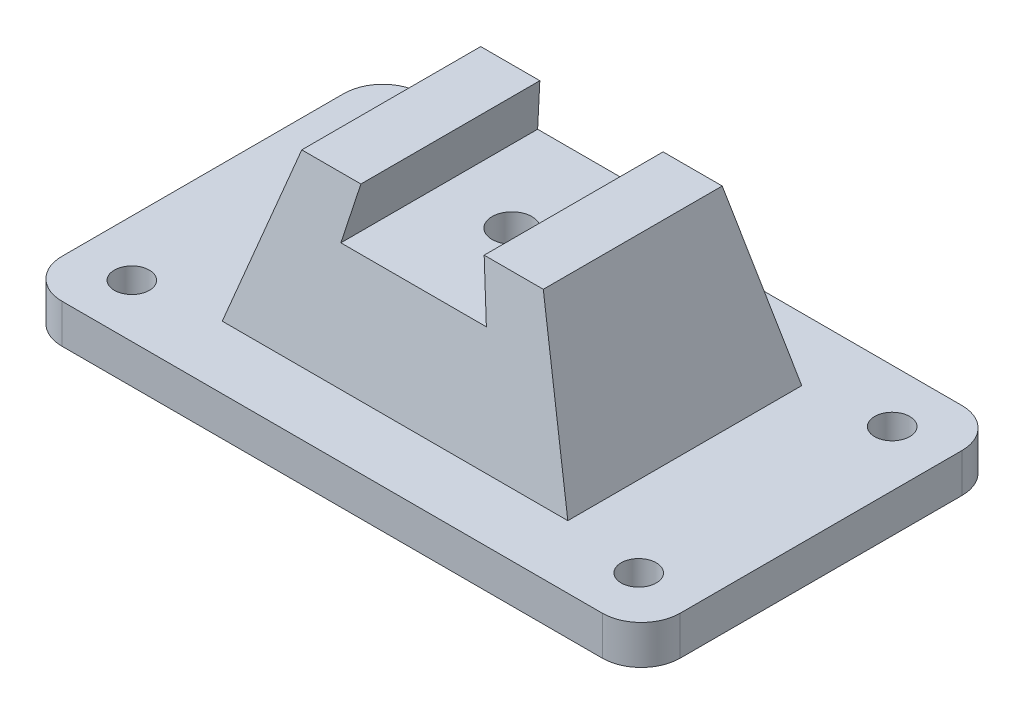
ISO-10303-21;
HEADER;
FILE_DESCRIPTION(('STEP AP214'),'2;1');
FILE_NAME('part.step','',(''),(''),'','','');
FILE_SCHEMA(('AUTOMOTIVE_DESIGN { 1 0 10303 214 1 1 1 1 }'));
ENDSEC;
DATA;
#1=APPLICATION_CONTEXT('core data for automotive mechanical design processes');
#2=APPLICATION_PROTOCOL_DEFINITION('international standard','automotive_design',2000,#1);
#3=PRODUCT_CONTEXT('',#1,'mechanical');
#4=PRODUCT('Part','Part','',(#3));
#5=PRODUCT_RELATED_PRODUCT_CATEGORY('part','',(#4));
#6=PRODUCT_DEFINITION_FORMATION('','',#4);
#7=PRODUCT_DEFINITION_CONTEXT('part definition',#1,'design');
#8=PRODUCT_DEFINITION('design','',#6,#7);
#9=PRODUCT_DEFINITION_SHAPE('','',#8);
#10=(LENGTH_UNIT() NAMED_UNIT(*) SI_UNIT(.MILLI.,.METRE.));
#11=(NAMED_UNIT(*) PLANE_ANGLE_UNIT() SI_UNIT($,.RADIAN.));
#12=(NAMED_UNIT(*) SI_UNIT($,.STERADIAN.) SOLID_ANGLE_UNIT());
#13=UNCERTAINTY_MEASURE_WITH_UNIT(LENGTH_MEASURE(1.E-05),#10,'distance_accuracy_value','');
#14=(GEOMETRIC_REPRESENTATION_CONTEXT(3) GLOBAL_UNCERTAINTY_ASSIGNED_CONTEXT((#13)) GLOBAL_UNIT_ASSIGNED_CONTEXT((#10,
#11,#12)) REPRESENTATION_CONTEXT('',''));
#15=CARTESIAN_POINT('',(0.,0.,0.));
#16=DIRECTION('',(0.,0.,1.));
#17=DIRECTION('',(1.,0.,0.));
#18=AXIS2_PLACEMENT_3D('',#15,#16,#17);
#19=CARTESIAN_POINT('',(-30.9686365671124,51.1938030802326,30.));
#20=DIRECTION('',(0.,-1.,0.));
#21=DIRECTION('',(0.,0.,-1.));
#22=AXIS2_PLACEMENT_3D('',#19,#20,#21);
#23=PLANE('',#22);
#24=DIRECTION('',(1.,0.,0.));
#25=VECTOR('',#24,1.);
#26=CARTESIAN_POINT('',(-79.2749011715995,51.1938030802326,-22.9454042551388));
#27=LINE('',#26,#25);
#28=CARTESIAN_POINT('',(15.8082579966013,51.1938030802326,-22.9454042551388));
#29=VERTEX_POINT('',#28);
#30=CARTESIAN_POINT('',(30.9686365671125,51.1938030802326,-22.9454042551388));
#31=VERTEX_POINT('',#30);
#32=EDGE_CURVE('E171',#29,#31,#27,.T.);
#33=ORIENTED_EDGE('',*,*,#32,.F.);
#34=DIRECTION('',(0.,0.,1.));
#35=VECTOR('',#34,1.);
#36=CARTESIAN_POINT('',(15.8082579966013,51.1938030802326,-46.1247583739828));
#37=LINE('',#36,#35);
#38=CARTESIAN_POINT('',(15.8082579966013,51.1938030802326,22.9454042551387));
#39=VERTEX_POINT('',#38);
#40=EDGE_CURVE('E156',#29,#39,#37,.T.);
#41=ORIENTED_EDGE('',*,*,#40,.T.);
#42=DIRECTION('',(1.,0.,0.));
#43=VECTOR('',#42,1.);
#44=CARTESIAN_POINT('',(-79.2749011715995,51.1938030802326,22.9454042551388));
#45=LINE('',#44,#43);
#46=CARTESIAN_POINT('',(30.9686365671125,51.1938030802326,22.9454042551388));
#47=VERTEX_POINT('',#46);
#48=EDGE_CURVE('E182',#39,#47,#45,.T.);
#49=ORIENTED_EDGE('',*,*,#48,.T.);
#50=DIRECTION('',(0.,0.,-1.));
#51=VECTOR('',#50,1.);
#52=CARTESIAN_POINT('',(30.9686365671124,51.1938030802326,30.));
#53=LINE('',#52,#51);
#54=EDGE_CURVE('E194',#47,#31,#53,.T.);
#55=ORIENTED_EDGE('',*,*,#54,.T.);
#56=EDGE_LOOP('',(#33,#41,#49,#55));
#57=FACE_BOUND('',#56,.T.);
#58=ADVANCED_FACE('F37',(#57),#23,.F.);
#59=CARTESIAN_POINT('',(69.2749011715995,10.,-36.1247583739828));
#60=DIRECTION('',(0.,-1.,0.));
#61=DIRECTION('',(0.,0.,-1.));
#62=AXIS2_PLACEMENT_3D('',#59,#60,#61);
#63=PLANE('',#62);
#64=CARTESIAN_POINT('',(-65.,10.,-32.5));
#65=DIRECTION('',(0.,1.,0.));
#66=DIRECTION('',(0.,0.,1.));
#67=AXIS2_PLACEMENT_3D('',#64,#65,#66);
#68=CIRCLE('',#67,4.5);
#69=CARTESIAN_POINT('',(-65.,10.,-28.));
#70=VERTEX_POINT('',#69);
#71=EDGE_CURVE('E297',#70,#70,#68,.T.);
#72=ORIENTED_EDGE('',*,*,#71,.F.);
#73=EDGE_LOOP('',(#72));
#74=FACE_BOUND('',#73,.T.);
#75=CARTESIAN_POINT('',(65.,10.,-32.5));
#76=DIRECTION('',(0.,1.,0.));
#77=DIRECTION('',(0.,0.,1.));
#78=AXIS2_PLACEMENT_3D('',#75,#76,#77);
#79=CIRCLE('',#78,4.49999999999999);
#80=CARTESIAN_POINT('',(65.,10.,-28.));
#81=VERTEX_POINT('',#80);
#82=EDGE_CURVE('E291',#81,#81,#79,.T.);
#83=ORIENTED_EDGE('',*,*,#82,.F.);
#84=EDGE_LOOP('',(#83));
#85=FACE_BOUND('',#84,.T.);
#86=CARTESIAN_POINT('',(65.,10.,32.5));
#87=DIRECTION('',(0.,1.,0.));
#88=DIRECTION('',(0.,0.,1.));
#89=AXIS2_PLACEMENT_3D('',#86,#87,#88);
#90=CIRCLE('',#89,4.49999999999999);
#91=CARTESIAN_POINT('',(65.,10.,37.));
#92=VERTEX_POINT('',#91);
#93=EDGE_CURVE('E285',#92,#92,#90,.T.);
#94=ORIENTED_EDGE('',*,*,#93,.F.);
#95=EDGE_LOOP('',(#94));
#96=FACE_BOUND('',#95,.T.);
#97=CARTESIAN_POINT('',(-65.,10.,32.5));
#98=DIRECTION('',(0.,1.,0.));
#99=DIRECTION('',(0.,0.,1.));
#100=AXIS2_PLACEMENT_3D('',#97,#98,#99);
#101=CIRCLE('',#100,4.5);
#102=CARTESIAN_POINT('',(-65.,10.,37.));
#103=VERTEX_POINT('',#102);
#104=EDGE_CURVE('E274',#103,#103,#101,.T.);
#105=ORIENTED_EDGE('',*,*,#104,.F.);
#106=EDGE_LOOP('',(#105));
#107=FACE_BOUND('',#106,.T.);
#108=DIRECTION('',(1.,0.,0.));
#109=VECTOR('',#108,1.);
#110=CARTESIAN_POINT('',(-44.314952744571,10.,-30.));
#111=LINE('',#110,#109);
#112=CARTESIAN_POINT('',(-44.314952744571,10.,-30.));
#113=VERTEX_POINT('',#112);
#114=CARTESIAN_POINT('',(44.314952744571,10.,-30.));
#115=VERTEX_POINT('',#114);
#116=EDGE_CURVE('E191',#113,#115,#111,.T.);
#117=ORIENTED_EDGE('',*,*,#116,.T.);
#118=DIRECTION('',(0.,0.,-1.));
#119=VECTOR('',#118,1.);
#120=CARTESIAN_POINT('',(44.314952744571,10.,30.));
#121=LINE('',#120,#119);
#122=CARTESIAN_POINT('',(44.314952744571,10.,30.));
#123=VERTEX_POINT('',#122);
#124=EDGE_CURVE('E199',#123,#115,#121,.T.);
#125=ORIENTED_EDGE('',*,*,#124,.F.);
#126=DIRECTION('',(1.,0.,0.));
#127=VECTOR('',#126,1.);
#128=CARTESIAN_POINT('',(-44.314952744571,10.,30.));
#129=LINE('',#128,#127);
#130=CARTESIAN_POINT('',(-44.314952744571,10.,30.));
#131=VERTEX_POINT('',#130);
#132=EDGE_CURVE('E192',#131,#123,#129,.T.);
#133=ORIENTED_EDGE('',*,*,#132,.F.);
#134=DIRECTION('',(0.,0.,-1.));
#135=VECTOR('',#134,1.);
#136=CARTESIAN_POINT('',(-44.314952744571,10.,30.));
#137=LINE('',#136,#135);
#138=EDGE_CURVE('E201',#131,#113,#137,.T.);
#139=ORIENTED_EDGE('',*,*,#138,.T.);
#140=EDGE_LOOP('',(#117,#125,#133,#139));
#141=FACE_BOUND('',#140,.T.);
#142=DIRECTION('',(0.,0.,-1.));
#143=VECTOR('',#142,1.);
#144=CARTESIAN_POINT('',(79.2749011715995,10.,-36.1247583739828));
#145=LINE('',#144,#143);
#146=CARTESIAN_POINT('',(79.2749011715995,10.,36.1247583739828));
#147=VERTEX_POINT('',#146);
#148=CARTESIAN_POINT('',(79.2749011715995,10.,-36.1247583739828));
#149=VERTEX_POINT('',#148);
#150=EDGE_CURVE('E224',#147,#149,#145,.T.);
#151=ORIENTED_EDGE('',*,*,#150,.T.);
#152=CARTESIAN_POINT('',(69.2749011715995,10.,-36.1247583739828));
#153=DIRECTION('',(0.,1.,0.));
#154=DIRECTION('',(0.,0.,-1.));
#155=AXIS2_PLACEMENT_3D('',#152,#153,#154);
#156=CIRCLE('',#155,9.99999999999999);
#157=CARTESIAN_POINT('',(69.2749011715995,10.,-46.1247583739828));
#158=VERTEX_POINT('',#157);
#159=EDGE_CURVE('E208',#149,#158,#156,.T.);
#160=ORIENTED_EDGE('',*,*,#159,.T.);
#161=DIRECTION('',(-1.,0.,0.));
#162=VECTOR('',#161,1.);
#163=CARTESIAN_POINT('',(-69.2749011715995,10.,-46.1247583739828));
#164=LINE('',#163,#162);
#165=CARTESIAN_POINT('',(-69.2749011715995,10.,-46.1247583739828));
#166=VERTEX_POINT('',#165);
#167=EDGE_CURVE('E211',#158,#166,#164,.T.);
#168=ORIENTED_EDGE('',*,*,#167,.T.);
#169=CARTESIAN_POINT('',(-69.2749011715995,10.,-36.1247583739828));
#170=DIRECTION('',(0.,1.,0.));
#171=DIRECTION('',(0.,0.,1.));
#172=AXIS2_PLACEMENT_3D('',#169,#170,#171);
#173=CIRCLE('',#172,9.99999999999999);
#174=CARTESIAN_POINT('',(-79.2749011715995,10.,-36.1247583739828));
#175=VERTEX_POINT('',#174);
#176=EDGE_CURVE('E214',#166,#175,#173,.T.);
#177=ORIENTED_EDGE('',*,*,#176,.T.);
#178=DIRECTION('',(0.,0.,1.));
#179=VECTOR('',#178,1.);
#180=CARTESIAN_POINT('',(-79.2749011715995,10.,-36.1247583739828));
#181=LINE('',#180,#179);
#182=CARTESIAN_POINT('',(-79.2749011715995,10.,36.1247583739828));
#183=VERTEX_POINT('',#182);
#184=EDGE_CURVE('E216',#175,#183,#181,.T.);
#185=ORIENTED_EDGE('',*,*,#184,.T.);
#186=CARTESIAN_POINT('',(-69.2749011715995,10.,36.1247583739828));
#187=DIRECTION('',(0.,1.,0.));
#188=DIRECTION('',(0.,0.,1.));
#189=AXIS2_PLACEMENT_3D('',#186,#187,#188);
#190=CIRCLE('',#189,9.99999999999999);
#191=CARTESIAN_POINT('',(-69.2749011715995,10.,46.1247583739828));
#192=VERTEX_POINT('',#191);
#193=EDGE_CURVE('E218',#183,#192,#190,.T.);
#194=ORIENTED_EDGE('',*,*,#193,.T.);
#195=DIRECTION('',(1.,0.,0.));
#196=VECTOR('',#195,1.);
#197=CARTESIAN_POINT('',(-69.2749011715995,10.,46.1247583739828));
#198=LINE('',#197,#196);
#199=CARTESIAN_POINT('',(69.2749011715995,10.,46.1247583739828));
#200=VERTEX_POINT('',#199);
#201=EDGE_CURVE('E220',#192,#200,#198,.T.);
#202=ORIENTED_EDGE('',*,*,#201,.T.);
#203=CARTESIAN_POINT('',(69.2749011715995,10.,36.1247583739828));
#204=DIRECTION('',(0.,1.,0.));
#205=DIRECTION('',(0.,0.,1.));
#206=AXIS2_PLACEMENT_3D('',#203,#204,#205);
#207=CIRCLE('',#206,9.99999999999999);
#208=EDGE_CURVE('E222',#200,#147,#207,.T.);
#209=ORIENTED_EDGE('',*,*,#208,.T.);
#210=EDGE_LOOP('',(#151,#160,#168,#177,#185,#194,#202,#209));
#211=FACE_BOUND('',#210,.T.);
#212=ADVANCED_FACE('F321',(#74,#85,#96,#107,#141,#211),#63,.F.);
#213=CARTESIAN_POINT('',(69.2749011715995,10.,-36.1247583739828));
#214=DIRECTION('',(0.,-1.,0.));
#215=DIRECTION('',(0.,0.,-1.));
#216=AXIS2_PLACEMENT_3D('',#213,#214,#215);
#217=CYLINDRICAL_SURFACE('',#216,9.99999999999999);
#218=CARTESIAN_POINT('',(69.2749011715995,0.,-36.1247583739828));
#219=DIRECTION('',(0.,1.,0.));
#220=DIRECTION('',(0.,0.,-1.));
#221=AXIS2_PLACEMENT_3D('',#218,#219,#220);
#222=CIRCLE('',#221,9.99999999999999);
#223=CARTESIAN_POINT('',(79.2749011715995,0.,-36.1247583739828));
#224=VERTEX_POINT('',#223);
#225=CARTESIAN_POINT('',(69.2749011715995,0.,-46.1247583739828));
#226=VERTEX_POINT('',#225);
#227=EDGE_CURVE('E207',#224,#226,#222,.T.);
#228=ORIENTED_EDGE('',*,*,#227,.T.);
#229=DIRECTION('',(0.,-1.,0.));
#230=VECTOR('',#229,1.);
#231=CARTESIAN_POINT('',(69.2749011715995,10.,-46.1247583739828));
#232=LINE('',#231,#230);
#233=EDGE_CURVE('E262',#158,#226,#232,.T.);
#234=ORIENTED_EDGE('',*,*,#233,.F.);
#235=ORIENTED_EDGE('',*,*,#159,.F.);
#236=DIRECTION('',(0.,-1.,0.));
#237=VECTOR('',#236,1.);
#238=CARTESIAN_POINT('',(79.2749011715995,10.,-36.1247583739828));
#239=LINE('',#238,#237);
#240=EDGE_CURVE('E226',#149,#224,#239,.T.);
#241=ORIENTED_EDGE('',*,*,#240,.T.);
#242=EDGE_LOOP('',(#228,#234,#235,#241));
#243=FACE_BOUND('',#242,.T.);
#244=ADVANCED_FACE('F39',(#243),#217,.T.);
#245=CARTESIAN_POINT('',(-69.2749011715995,10.,-46.1247583739828));
#246=DIRECTION('',(0.,0.,1.));
#247=DIRECTION('',(1.,0.,0.));
#248=AXIS2_PLACEMENT_3D('',#245,#246,#247);
#249=PLANE('',#248);
#250=DIRECTION('',(-1.,0.,0.));
#251=VECTOR('',#250,1.);
#252=CARTESIAN_POINT('',(-69.2749011715995,0.,-46.1247583739828));
#253=LINE('',#252,#251);
#254=CARTESIAN_POINT('',(-69.2749011715995,0.,-46.1247583739828));
#255=VERTEX_POINT('',#254);
#256=EDGE_CURVE('E229',#226,#255,#253,.T.);
#257=ORIENTED_EDGE('',*,*,#256,.T.);
#258=DIRECTION('',(0.,-1.,0.));
#259=VECTOR('',#258,1.);
#260=CARTESIAN_POINT('',(-69.2749011715995,10.,-46.1247583739828));
#261=LINE('',#260,#259);
#262=EDGE_CURVE('E259',#166,#255,#261,.T.);
#263=ORIENTED_EDGE('',*,*,#262,.F.);
#264=ORIENTED_EDGE('',*,*,#167,.F.);
#265=ORIENTED_EDGE('',*,*,#233,.T.);
#266=EDGE_LOOP('',(#257,#263,#264,#265));
#267=FACE_BOUND('',#266,.T.);
#268=ADVANCED_FACE('F367',(#267),#249,.F.);
#269=CARTESIAN_POINT('',(-69.2749011715995,10.,-36.1247583739828));
#270=DIRECTION('',(0.,-1.,0.));
#271=DIRECTION('',(0.,0.,-1.));
#272=AXIS2_PLACEMENT_3D('',#269,#270,#271);
#273=CYLINDRICAL_SURFACE('',#272,9.99999999999999);
#274=CARTESIAN_POINT('',(-69.2749011715995,0.,-36.1247583739828));
#275=DIRECTION('',(0.,1.,0.));
#276=DIRECTION('',(0.,0.,1.));
#277=AXIS2_PLACEMENT_3D('',#274,#275,#276);
#278=CIRCLE('',#277,9.99999999999999);
#279=CARTESIAN_POINT('',(-79.2749011715995,0.,-36.1247583739828));
#280=VERTEX_POINT('',#279);
#281=EDGE_CURVE('E231',#255,#280,#278,.T.);
#282=ORIENTED_EDGE('',*,*,#281,.T.);
#283=DIRECTION('',(0.,-1.,0.));
#284=VECTOR('',#283,1.);
#285=CARTESIAN_POINT('',(-79.2749011715995,10.,-36.1247583739828));
#286=LINE('',#285,#284);
#287=EDGE_CURVE('E256',#175,#280,#286,.T.);
#288=ORIENTED_EDGE('',*,*,#287,.F.);
#289=ORIENTED_EDGE('',*,*,#176,.F.);
#290=ORIENTED_EDGE('',*,*,#262,.T.);
#291=EDGE_LOOP('',(#282,#288,#289,#290));
#292=FACE_BOUND('',#291,.T.);
#293=ADVANCED_FACE('F364',(#292),#273,.T.);
#294=CARTESIAN_POINT('',(-79.2749011715995,10.,-36.1247583739828));
#295=DIRECTION('',(1.,0.,0.));
#296=DIRECTION('',(0.,0.,-1.));
#297=AXIS2_PLACEMENT_3D('',#294,#295,#296);
#298=PLANE('',#297);
#299=DIRECTION('',(0.,0.,1.));
#300=VECTOR('',#299,1.);
#301=CARTESIAN_POINT('',(-79.2749011715995,0.,-36.1247583739828));
#302=LINE('',#301,#300);
#303=CARTESIAN_POINT('',(-79.2749011715995,0.,36.1247583739828));
#304=VERTEX_POINT('',#303);
#305=EDGE_CURVE('E233',#280,#304,#302,.T.);
#306=ORIENTED_EDGE('',*,*,#305,.T.);
#307=DIRECTION('',(0.,-1.,0.));
#308=VECTOR('',#307,1.);
#309=CARTESIAN_POINT('',(-79.2749011715995,10.,36.1247583739828));
#310=LINE('',#309,#308);
#311=EDGE_CURVE('E253',#183,#304,#310,.T.);
#312=ORIENTED_EDGE('',*,*,#311,.F.);
#313=ORIENTED_EDGE('',*,*,#184,.F.);
#314=ORIENTED_EDGE('',*,*,#287,.T.);
#315=EDGE_LOOP('',(#306,#312,#313,#314));
#316=FACE_BOUND('',#315,.T.);
#317=ADVANCED_FACE('F360',(#316),#298,.F.);
#318=CARTESIAN_POINT('',(-69.2749011715995,10.,36.1247583739828));
#319=DIRECTION('',(0.,-1.,0.));
#320=DIRECTION('',(0.,0.,-1.));
#321=AXIS2_PLACEMENT_3D('',#318,#319,#320);
#322=CYLINDRICAL_SURFACE('',#321,9.99999999999999);
#323=CARTESIAN_POINT('',(-69.2749011715995,0.,36.1247583739828));
#324=DIRECTION('',(0.,1.,0.));
#325=DIRECTION('',(0.,0.,1.));
#326=AXIS2_PLACEMENT_3D('',#323,#324,#325);
#327=CIRCLE('',#326,9.99999999999999);
#328=CARTESIAN_POINT('',(-69.2749011715995,0.,46.1247583739828));
#329=VERTEX_POINT('',#328);
#330=EDGE_CURVE('E235',#304,#329,#327,.T.);
#331=ORIENTED_EDGE('',*,*,#330,.T.);
#332=DIRECTION('',(0.,-1.,0.));
#333=VECTOR('',#332,1.);
#334=CARTESIAN_POINT('',(-69.2749011715995,10.,46.1247583739828));
#335=LINE('',#334,#333);
#336=EDGE_CURVE('E250',#192,#329,#335,.T.);
#337=ORIENTED_EDGE('',*,*,#336,.F.);
#338=ORIENTED_EDGE('',*,*,#193,.F.);
#339=ORIENTED_EDGE('',*,*,#311,.T.);
#340=EDGE_LOOP('',(#331,#337,#338,#339));
#341=FACE_BOUND('',#340,.T.);
#342=ADVANCED_FACE('F356',(#341),#322,.T.);
#343=CARTESIAN_POINT('',(-69.2749011715995,10.,46.1247583739828));
#344=DIRECTION('',(0.,0.,-1.));
#345=DIRECTION('',(-1.,0.,0.));
#346=AXIS2_PLACEMENT_3D('',#343,#344,#345);
#347=PLANE('',#346);
#348=DIRECTION('',(1.,0.,0.));
#349=VECTOR('',#348,1.);
#350=CARTESIAN_POINT('',(-69.2749011715995,0.,46.1247583739828));
#351=LINE('',#350,#349);
#352=CARTESIAN_POINT('',(69.2749011715995,0.,46.1247583739828));
#353=VERTEX_POINT('',#352);
#354=EDGE_CURVE('E237',#329,#353,#351,.T.);
#355=ORIENTED_EDGE('',*,*,#354,.T.);
#356=DIRECTION('',(0.,-1.,0.));
#357=VECTOR('',#356,1.);
#358=CARTESIAN_POINT('',(69.2749011715995,10.,46.1247583739828));
#359=LINE('',#358,#357);
#360=EDGE_CURVE('E247',#200,#353,#359,.T.);
#361=ORIENTED_EDGE('',*,*,#360,.F.);
#362=ORIENTED_EDGE('',*,*,#201,.F.);
#363=ORIENTED_EDGE('',*,*,#336,.T.);
#364=EDGE_LOOP('',(#355,#361,#362,#363));
#365=FACE_BOUND('',#364,.T.);
#366=ADVANCED_FACE('F352',(#365),#347,.F.);
#367=CARTESIAN_POINT('',(69.2749011715995,10.,36.1247583739828));
#368=DIRECTION('',(0.,-1.,0.));
#369=DIRECTION('',(0.,0.,-1.));
#370=AXIS2_PLACEMENT_3D('',#367,#368,#369);
#371=CYLINDRICAL_SURFACE('',#370,9.99999999999999);
#372=CARTESIAN_POINT('',(69.2749011715995,0.,36.1247583739828));
#373=DIRECTION('',(0.,1.,0.));
#374=DIRECTION('',(0.,0.,1.));
#375=AXIS2_PLACEMENT_3D('',#372,#373,#374);
#376=CIRCLE('',#375,9.99999999999999);
#377=CARTESIAN_POINT('',(79.2749011715995,0.,36.1247583739828));
#378=VERTEX_POINT('',#377);
#379=EDGE_CURVE('E239',#353,#378,#376,.T.);
#380=ORIENTED_EDGE('',*,*,#379,.T.);
#381=DIRECTION('',(0.,-1.,0.));
#382=VECTOR('',#381,1.);
#383=CARTESIAN_POINT('',(79.2749011715995,10.,36.1247583739828));
#384=LINE('',#383,#382);
#385=EDGE_CURVE('E244',#147,#378,#384,.T.);
#386=ORIENTED_EDGE('',*,*,#385,.F.);
#387=ORIENTED_EDGE('',*,*,#208,.F.);
#388=ORIENTED_EDGE('',*,*,#360,.T.);
#389=EDGE_LOOP('',(#380,#386,#387,#388));
#390=FACE_BOUND('',#389,.T.);
#391=ADVANCED_FACE('F345',(#390),#371,.T.);
#392=CARTESIAN_POINT('',(79.2749011715995,10.,-36.1247583739828));
#393=DIRECTION('',(-1.,0.,0.));
#394=DIRECTION('',(0.,0.,1.));
#395=AXIS2_PLACEMENT_3D('',#392,#393,#394);
#396=PLANE('',#395);
#397=DIRECTION('',(0.,0.,-1.));
#398=VECTOR('',#397,1.);
#399=CARTESIAN_POINT('',(79.2749011715995,0.,-36.1247583739828));
#400=LINE('',#399,#398);
#401=EDGE_CURVE('E212',#378,#224,#400,.T.);
#402=ORIENTED_EDGE('',*,*,#401,.T.);
#403=ORIENTED_EDGE('',*,*,#240,.F.);
#404=ORIENTED_EDGE('',*,*,#150,.F.);
#405=ORIENTED_EDGE('',*,*,#385,.T.);
#406=EDGE_LOOP('',(#402,#403,#404,#405));
#407=FACE_BOUND('',#406,.T.);
#408=ADVANCED_FACE('F339',(#407),#396,.F.);
#409=CARTESIAN_POINT('',(69.2749011715995,0.,-36.1247583739828));
#410=DIRECTION('',(0.,-1.,0.));
#411=DIRECTION('',(0.,0.,-1.));
#412=AXIS2_PLACEMENT_3D('',#409,#410,#411);
#413=PLANE('',#412);
#414=CARTESIAN_POINT('',(0.,0.,0.));
#415=DIRECTION('',(0.,1.,0.));
#416=DIRECTION('',(0.,0.,1.));
#417=AXIS2_PLACEMENT_3D('',#414,#415,#416);
#418=CIRCLE('',#417,5.09999999999999);
#419=CARTESIAN_POINT('',(0.,0.,5.09999999999999));
#420=VERTEX_POINT('',#419);
#421=EDGE_CURVE('E300',#420,#420,#418,.T.);
#422=ORIENTED_EDGE('',*,*,#421,.T.);
#423=EDGE_LOOP('',(#422));
#424=FACE_BOUND('',#423,.T.);
#425=CARTESIAN_POINT('',(-65.,0.,-32.5));
#426=DIRECTION('',(0.,1.,0.));
#427=DIRECTION('',(0.,0.,1.));
#428=AXIS2_PLACEMENT_3D('',#425,#426,#427);
#429=CIRCLE('',#428,4.5);
#430=CARTESIAN_POINT('',(-65.,0.,-28.));
#431=VERTEX_POINT('',#430);
#432=EDGE_CURVE('E294',#431,#431,#429,.T.);
#433=ORIENTED_EDGE('',*,*,#432,.T.);
#434=EDGE_LOOP('',(#433));
#435=FACE_BOUND('',#434,.T.);
#436=CARTESIAN_POINT('',(65.,0.,-32.5));
#437=DIRECTION('',(0.,1.,0.));
#438=DIRECTION('',(0.,0.,1.));
#439=AXIS2_PLACEMENT_3D('',#436,#437,#438);
#440=CIRCLE('',#439,4.49999999999999);
#441=CARTESIAN_POINT('',(65.,0.,-28.));
#442=VERTEX_POINT('',#441);
#443=EDGE_CURVE('E288',#442,#442,#440,.T.);
#444=ORIENTED_EDGE('',*,*,#443,.T.);
#445=EDGE_LOOP('',(#444));
#446=FACE_BOUND('',#445,.T.);
#447=CARTESIAN_POINT('',(65.,0.,32.5));
#448=DIRECTION('',(0.,1.,0.));
#449=DIRECTION('',(0.,0.,1.));
#450=AXIS2_PLACEMENT_3D('',#447,#448,#449);
#451=CIRCLE('',#450,4.49999999999999);
#452=CARTESIAN_POINT('',(65.,0.,37.));
#453=VERTEX_POINT('',#452);
#454=EDGE_CURVE('E282',#453,#453,#451,.T.);
#455=ORIENTED_EDGE('',*,*,#454,.T.);
#456=EDGE_LOOP('',(#455));
#457=FACE_BOUND('',#456,.T.);
#458=CARTESIAN_POINT('',(-65.,0.,32.5));
#459=DIRECTION('',(0.,1.,0.));
#460=DIRECTION('',(0.,0.,1.));
#461=AXIS2_PLACEMENT_3D('',#458,#459,#460);
#462=CIRCLE('',#461,4.5);
#463=CARTESIAN_POINT('',(-65.,0.,37.));
#464=VERTEX_POINT('',#463);
#465=EDGE_CURVE('E272',#464,#464,#462,.T.);
#466=ORIENTED_EDGE('',*,*,#465,.T.);
#467=EDGE_LOOP('',(#466));
#468=FACE_BOUND('',#467,.T.);
#469=ORIENTED_EDGE('',*,*,#227,.F.);
#470=ORIENTED_EDGE('',*,*,#401,.F.);
#471=ORIENTED_EDGE('',*,*,#379,.F.);
#472=ORIENTED_EDGE('',*,*,#354,.F.);
#473=ORIENTED_EDGE('',*,*,#330,.F.);
#474=ORIENTED_EDGE('',*,*,#305,.F.);
#475=ORIENTED_EDGE('',*,*,#281,.F.);
#476=ORIENTED_EDGE('',*,*,#256,.F.);
#477=EDGE_LOOP('',(#469,#470,#471,#472,#473,#474,#475,#476));
#478=FACE_BOUND('',#477,.T.);
#479=ADVANCED_FACE('F332',(#424,#435,#446,#457,#468,#478),#413,.T.);
#480=CARTESIAN_POINT('',(-30.9686365671124,51.1938030802326,22.9454042551388));
#481=VERTEX_POINT('',#480);
#482=CARTESIAN_POINT('',(-15.8082579966013,51.1938030802326,22.9454042551388));
#483=VERTEX_POINT('',#482);
#484=EDGE_CURVE('E183',#481,#483,#45,.T.);
#485=ORIENTED_EDGE('',*,*,#484,.T.);
#486=DIRECTION('',(0.,0.,1.));
#487=VECTOR('',#486,1.);
#488=CARTESIAN_POINT('',(-15.8082579966013,51.1938030802326,-46.1247583739828));
#489=LINE('',#488,#487);
#490=CARTESIAN_POINT('',(-15.8082579966013,51.1938030802326,-22.9454042551388));
#491=VERTEX_POINT('',#490);
#492=EDGE_CURVE('E151',#491,#483,#489,.T.);
#493=ORIENTED_EDGE('',*,*,#492,.F.);
#494=CARTESIAN_POINT('',(-30.9686365671124,51.1938030802326,-22.9454042551388));
#495=VERTEX_POINT('',#494);
#496=EDGE_CURVE('E175',#495,#491,#27,.T.);
#497=ORIENTED_EDGE('',*,*,#496,.F.);
#498=DIRECTION('',(0.,0.,-1.));
#499=VECTOR('',#498,1.);
#500=CARTESIAN_POINT('',(-30.9686365671124,51.1938030802326,30.));
#501=LINE('',#500,#499);
#502=EDGE_CURVE('E204',#481,#495,#501,.T.);
#503=ORIENTED_EDGE('',*,*,#502,.F.);
#504=EDGE_LOOP('',(#485,#493,#497,#503));
#505=FACE_BOUND('',#504,.T.);
#506=ADVANCED_FACE('F270',(#505),#23,.F.);
#507=CARTESIAN_POINT('',(-30.9686365671124,51.1938030802326,30.));
#508=DIRECTION('',(0.951316542693786,-0.308215566766415,0.));
#509=DIRECTION('',(0.308215566766415,0.951316542693786,0.));
#510=AXIS2_PLACEMENT_3D('',#507,#508,#509);
#511=PLANE('',#510);
#512=ORIENTED_EDGE('',*,*,#502,.T.);
#513=DIRECTION('',(-0.304204929705067,-0.938937591743224,-0.160796640370904));
#514=VECTOR('',#513,1.);
#515=CARTESIAN_POINT('',(-28.3788051990223,59.1873948676279,-21.5764712022792));
#516=LINE('',#515,#514);
#517=EDGE_CURVE('E179',#495,#113,#516,.T.);
#518=ORIENTED_EDGE('',*,*,#517,.T.);
#519=ORIENTED_EDGE('',*,*,#138,.F.);
#520=DIRECTION('',(0.304204929705067,0.938937591743224,-0.160796640370904));
#521=VECTOR('',#520,1.);
#522=CARTESIAN_POINT('',(-31.3137130398728,50.1287142514124,23.1278047755534));
#523=LINE('',#522,#521);
#524=EDGE_CURVE('E188',#131,#481,#523,.T.);
#525=ORIENTED_EDGE('',*,*,#524,.T.);
#526=EDGE_LOOP('',(#512,#518,#519,#525));
#527=FACE_BOUND('',#526,.T.);
#528=ADVANCED_FACE('F331',(#527),#511,.F.);
#529=CARTESIAN_POINT('',(30.9686365671124,51.1938030802326,30.));
#530=DIRECTION('',(-0.951316542693786,-0.308215566766415,0.));
#531=DIRECTION('',(0.308215566766415,-0.951316542693786,0.));
#532=AXIS2_PLACEMENT_3D('',#529,#530,#531);
#533=PLANE('',#532);
#534=ORIENTED_EDGE('',*,*,#124,.T.);
#535=DIRECTION('',(-0.304204929705067,0.938937591743224,0.160796640370904));
#536=VECTOR('',#535,1.);
#537=CARTESIAN_POINT('',(28.3788051990223,59.1873948676279,-21.5764712022792));
#538=LINE('',#537,#536);
#539=EDGE_CURVE('E60',#115,#31,#538,.T.);
#540=ORIENTED_EDGE('',*,*,#539,.T.);
#541=ORIENTED_EDGE('',*,*,#54,.F.);
#542=DIRECTION('',(0.304204929705067,-0.938937591743224,0.160796640370904));
#543=VECTOR('',#542,1.);
#544=CARTESIAN_POINT('',(31.3137130398728,50.1287142514124,23.1278047755534));
#545=LINE('',#544,#543);
#546=EDGE_CURVE('E185',#47,#123,#545,.T.);
#547=ORIENTED_EDGE('',*,*,#546,.T.);
#548=EDGE_LOOP('',(#534,#540,#541,#547));
#549=FACE_BOUND('',#548,.T.);
#550=ADVANCED_FACE('F337',(#549),#533,.F.);
#551=CARTESIAN_POINT('',(-79.2749011715995,10.,30.));
#552=DIRECTION('',(0.,-0.168796476986144,-0.985650926726631));
#553=DIRECTION('',(0.,0.985650926726631,-0.168796476986144));
#554=AXIS2_PLACEMENT_3D('',#551,#552,#553);
#555=PLANE('',#554);
#556=ORIENTED_EDGE('',*,*,#48,.F.);
#557=DIRECTION('',(0.205927792635881,-0.964525657121514,0.165178694069256));
#558=VECTOR('',#557,1.);
#559=CARTESIAN_POINT('',(20.198120382818,30.6325429970664,26.4665983922563));
#560=LINE('',#559,#558);
#561=CARTESIAN_POINT('',(18.6589274713983,37.8418226932214,25.2319817736121));
#562=VERTEX_POINT('',#561);
#563=EDGE_CURVE('E169',#39,#562,#560,.T.);
#564=ORIENTED_EDGE('',*,*,#563,.T.);
#565=DIRECTION('',(-1.,0.,0.));
#566=VECTOR('',#565,1.);
#567=CARTESIAN_POINT('',(-79.2749011715995,37.8418226932214,25.2319817736121));
#568=LINE('',#567,#566);
#569=CARTESIAN_POINT('',(-18.6589274713983,37.8418226932214,25.2319817736122));
#570=VERTEX_POINT('',#569);
#571=EDGE_CURVE('E155',#562,#570,#568,.T.);
#572=ORIENTED_EDGE('',*,*,#571,.T.);
#573=DIRECTION('',(0.205927792635881,0.964525657121514,-0.165178694069256));
#574=VECTOR('',#573,1.);
#575=CARTESIAN_POINT('',(-26.9216238548341,-0.85903723839912,31.8596515050115));
#576=LINE('',#575,#574);
#577=EDGE_CURVE('E148',#570,#483,#576,.T.);
#578=ORIENTED_EDGE('',*,*,#577,.T.);
#579=ORIENTED_EDGE('',*,*,#484,.F.);
#580=ORIENTED_EDGE('',*,*,#524,.F.);
#581=ORIENTED_EDGE('',*,*,#132,.T.);
#582=ORIENTED_EDGE('',*,*,#546,.F.);
#583=EDGE_LOOP('',(#556,#564,#572,#578,#579,#580,#581,#582));
#584=FACE_BOUND('',#583,.T.);
#585=ADVANCED_FACE('F168',(#584),#555,.F.);
#586=CARTESIAN_POINT('',(-79.2749011715995,10.,-30.));
#587=DIRECTION('',(0.,-0.168796476986144,0.985650926726631));
#588=DIRECTION('',(0.,-0.985650926726631,-0.168796476986144));
#589=AXIS2_PLACEMENT_3D('',#586,#587,#588);
#590=PLANE('',#589);
#591=DIRECTION('',(1.,0.,0.));
#592=VECTOR('',#591,1.);
#593=CARTESIAN_POINT('',(-79.2749011715995,37.8418226932214,-25.2319817736121));
#594=LINE('',#593,#592);
#595=CARTESIAN_POINT('',(-18.6589274713983,37.8418226932214,-25.2319817736121));
#596=VERTEX_POINT('',#595);
#597=CARTESIAN_POINT('',(18.6589274713983,37.8418226932214,-25.2319817736121));
#598=VERTEX_POINT('',#597);
#599=EDGE_CURVE('E45',#596,#598,#594,.T.);
#600=ORIENTED_EDGE('',*,*,#599,.T.);
#601=DIRECTION('',(-0.205927792635881,0.964525657121514,0.165178694069256));
#602=VECTOR('',#601,1.);
#603=CARTESIAN_POINT('',(20.198120382818,30.6325429970664,-26.4665983922563));
#604=LINE('',#603,#602);
#605=EDGE_CURVE('E11',#598,#29,#604,.T.);
#606=ORIENTED_EDGE('',*,*,#605,.T.);
#607=ORIENTED_EDGE('',*,*,#32,.T.);
#608=ORIENTED_EDGE('',*,*,#539,.F.);
#609=ORIENTED_EDGE('',*,*,#116,.F.);
#610=ORIENTED_EDGE('',*,*,#517,.F.);
#611=ORIENTED_EDGE('',*,*,#496,.T.);
#612=DIRECTION('',(-0.205927792635881,-0.964525657121514,-0.165178694069256));
#613=VECTOR('',#612,1.);
#614=CARTESIAN_POINT('',(-26.9216238548341,-0.85903723839912,-31.8596515050115));
#615=LINE('',#614,#613);
#616=EDGE_CURVE('E265',#491,#596,#615,.T.);
#617=ORIENTED_EDGE('',*,*,#616,.T.);
#618=EDGE_LOOP('',(#600,#606,#607,#608,#609,#610,#611,#617));
#619=FACE_BOUND('',#618,.T.);
#620=ADVANCED_FACE('F266',(#619),#590,.F.);
#621=CARTESIAN_POINT('',(15.8082579966013,51.1938030802326,-46.1247583739828));
#622=DIRECTION('',(0.977959241744036,0.208795884747354,0.));
#623=DIRECTION('',(-0.208795884747354,0.977959241744036,0.));
#624=AXIS2_PLACEMENT_3D('',#621,#622,#623);
#625=PLANE('',#624);
#626=ORIENTED_EDGE('',*,*,#40,.F.);
#627=ORIENTED_EDGE('',*,*,#605,.F.);
#628=DIRECTION('',(0.,0.,1.));
#629=VECTOR('',#628,1.);
#630=CARTESIAN_POINT('',(18.6589274713983,37.8418226932214,-46.1247583739828));
#631=LINE('',#630,#629);
#632=EDGE_CURVE('E164',#598,#562,#631,.T.);
#633=ORIENTED_EDGE('',*,*,#632,.T.);
#634=ORIENTED_EDGE('',*,*,#563,.F.);
#635=EDGE_LOOP('',(#626,#627,#633,#634));
#636=FACE_BOUND('',#635,.T.);
#637=ADVANCED_FACE('F310',(#636),#625,.F.);
#638=CARTESIAN_POINT('',(-18.6589274713983,37.8418226932214,-46.1247583739828));
#639=DIRECTION('',(0.,-1.,0.));
#640=DIRECTION('',(1.,0.,0.));
#641=AXIS2_PLACEMENT_3D('',#638,#639,#640);
#642=PLANE('',#641);
#643=CARTESIAN_POINT('',(0.,37.8418226932214,0.));
#644=DIRECTION('',(0.,1.,0.));
#645=DIRECTION('',(0.,0.,1.));
#646=AXIS2_PLACEMENT_3D('',#643,#644,#645);
#647=CIRCLE('',#646,5.1);
#648=CARTESIAN_POINT('',(0.,37.8418226932214,5.1));
#649=VERTEX_POINT('',#648);
#650=EDGE_CURVE('E303',#649,#649,#647,.T.);
#651=ORIENTED_EDGE('',*,*,#650,.F.);
#652=EDGE_LOOP('',(#651));
#653=FACE_BOUND('',#652,.T.);
#654=ORIENTED_EDGE('',*,*,#632,.F.);
#655=ORIENTED_EDGE('',*,*,#599,.F.);
#656=DIRECTION('',(0.,0.,1.));
#657=VECTOR('',#656,1.);
#658=CARTESIAN_POINT('',(-18.6589274713983,37.8418226932214,-46.1247583739828));
#659=LINE('',#658,#657);
#660=EDGE_CURVE('E52',#596,#570,#659,.T.);
#661=ORIENTED_EDGE('',*,*,#660,.T.);
#662=ORIENTED_EDGE('',*,*,#571,.F.);
#663=EDGE_LOOP('',(#654,#655,#661,#662));
#664=FACE_BOUND('',#663,.T.);
#665=ADVANCED_FACE('F160',(#653,#664),#642,.F.);
#666=CARTESIAN_POINT('',(-15.8082579966013,51.1938030802326,-46.1247583739828));
#667=DIRECTION('',(-0.977959241744036,0.208795884747354,0.));
#668=DIRECTION('',(-0.208795884747354,-0.977959241744036,0.));
#669=AXIS2_PLACEMENT_3D('',#666,#667,#668);
#670=PLANE('',#669);
#671=ORIENTED_EDGE('',*,*,#660,.F.);
#672=ORIENTED_EDGE('',*,*,#616,.F.);
#673=ORIENTED_EDGE('',*,*,#492,.T.);
#674=ORIENTED_EDGE('',*,*,#577,.F.);
#675=EDGE_LOOP('',(#671,#672,#673,#674));
#676=FACE_BOUND('',#675,.T.);
#677=ADVANCED_FACE('F149',(#676),#670,.F.);
#678=CARTESIAN_POINT('',(-65.,10.,32.5));
#679=DIRECTION('',(0.,1.,0.));
#680=DIRECTION('',(0.,0.,1.));
#681=AXIS2_PLACEMENT_3D('',#678,#679,#680);
#682=CYLINDRICAL_SURFACE('',#681,4.5);
#683=ORIENTED_EDGE('',*,*,#465,.F.);
#684=EDGE_LOOP('',(#683));
#685=FACE_BOUND('',#684,.T.);
#686=ORIENTED_EDGE('',*,*,#104,.T.);
#687=EDGE_LOOP('',(#686));
#688=FACE_BOUND('',#687,.T.);
#689=ADVANCED_FACE('F316',(#685,#688),#682,.F.);
#690=CARTESIAN_POINT('',(65.,10.,32.5));
#691=DIRECTION('',(0.,1.,0.));
#692=DIRECTION('',(0.,0.,1.));
#693=AXIS2_PLACEMENT_3D('',#690,#691,#692);
#694=CYLINDRICAL_SURFACE('',#693,4.49999999999999);
#695=ORIENTED_EDGE('',*,*,#454,.F.);
#696=EDGE_LOOP('',(#695));
#697=FACE_BOUND('',#696,.T.);
#698=ORIENTED_EDGE('',*,*,#93,.T.);
#699=EDGE_LOOP('',(#698));
#700=FACE_BOUND('',#699,.T.);
#701=ADVANCED_FACE('F420',(#697,#700),#694,.F.);
#702=CARTESIAN_POINT('',(65.,10.,-32.5));
#703=DIRECTION('',(0.,1.,0.));
#704=DIRECTION('',(0.,0.,1.));
#705=AXIS2_PLACEMENT_3D('',#702,#703,#704);
#706=CYLINDRICAL_SURFACE('',#705,4.49999999999999);
#707=ORIENTED_EDGE('',*,*,#443,.F.);
#708=EDGE_LOOP('',(#707));
#709=FACE_BOUND('',#708,.T.);
#710=ORIENTED_EDGE('',*,*,#82,.T.);
#711=EDGE_LOOP('',(#710));
#712=FACE_BOUND('',#711,.T.);
#713=ADVANCED_FACE('F430',(#709,#712),#706,.F.);
#714=CARTESIAN_POINT('',(-65.,10.,-32.5));
#715=DIRECTION('',(0.,1.,0.));
#716=DIRECTION('',(0.,0.,1.));
#717=AXIS2_PLACEMENT_3D('',#714,#715,#716);
#718=CYLINDRICAL_SURFACE('',#717,4.5);
#719=ORIENTED_EDGE('',*,*,#432,.F.);
#720=EDGE_LOOP('',(#719));
#721=FACE_BOUND('',#720,.T.);
#722=ORIENTED_EDGE('',*,*,#71,.T.);
#723=EDGE_LOOP('',(#722));
#724=FACE_BOUND('',#723,.T.);
#725=ADVANCED_FACE('F440',(#721,#724),#718,.F.);
#726=CARTESIAN_POINT('',(0.,37.8418226932214,0.));
#727=DIRECTION('',(0.,1.,0.));
#728=DIRECTION('',(0.,0.,1.));
#729=AXIS2_PLACEMENT_3D('',#726,#727,#728);
#730=CYLINDRICAL_SURFACE('',#729,5.09999999999999);
#731=ORIENTED_EDGE('',*,*,#421,.F.);
#732=EDGE_LOOP('',(#731));
#733=FACE_BOUND('',#732,.T.);
#734=ORIENTED_EDGE('',*,*,#650,.T.);
#735=EDGE_LOOP('',(#734));
#736=FACE_BOUND('',#735,.T.);
#737=ADVANCED_FACE('F307',(#733,#736),#730,.F.);
#738=CLOSED_SHELL('',(#58,#212,#244,#268,#293,#317,#342,#366,#391,#408,#479,#506,#528,#550,#585,
#620,#637,#665,#677,#689,#701,#713,#725,#737));
#739=MANIFOLD_SOLID_BREP('B2',#738);
#740=ADVANCED_BREP_SHAPE_REPRESENTATION('',(#18,#739),#14);
#741=SHAPE_DEFINITION_REPRESENTATION(#9,#740);
ENDSEC;
END-ISO-10303-21;
